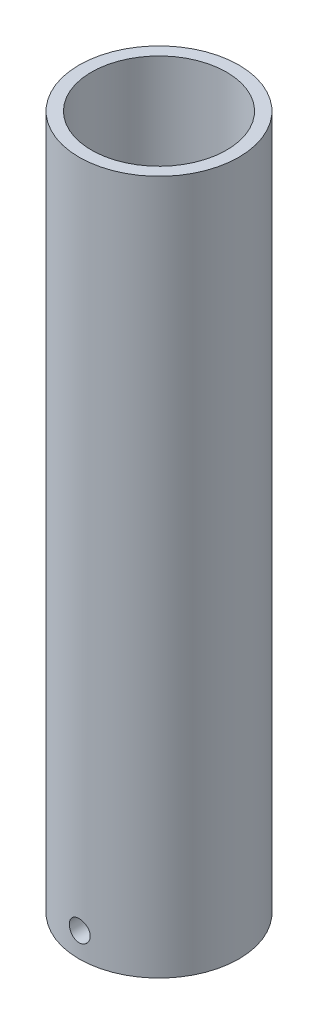
ISO-10303-21;
HEADER;
FILE_DESCRIPTION(('STEP AP214'),'2;1');
FILE_NAME('part.step','',(''),(''),'','','');
FILE_SCHEMA(('AUTOMOTIVE_DESIGN { 1 0 10303 214 1 1 1 1 }'));
ENDSEC;
DATA;
#1=APPLICATION_CONTEXT('core data for automotive mechanical design processes');
#2=APPLICATION_PROTOCOL_DEFINITION('international standard','automotive_design',2000,#1);
#3=PRODUCT_CONTEXT('',#1,'mechanical');
#4=PRODUCT('Part','Part','',(#3));
#5=PRODUCT_RELATED_PRODUCT_CATEGORY('part','',(#4));
#6=PRODUCT_DEFINITION_FORMATION('','',#4);
#7=PRODUCT_DEFINITION_CONTEXT('part definition',#1,'design');
#8=PRODUCT_DEFINITION('design','',#6,#7);
#9=PRODUCT_DEFINITION_SHAPE('','',#8);
#10=(LENGTH_UNIT() NAMED_UNIT(*) SI_UNIT(.MILLI.,.METRE.));
#11=(NAMED_UNIT(*) PLANE_ANGLE_UNIT() SI_UNIT($,.RADIAN.));
#12=(NAMED_UNIT(*) SI_UNIT($,.STERADIAN.) SOLID_ANGLE_UNIT());
#13=UNCERTAINTY_MEASURE_WITH_UNIT(LENGTH_MEASURE(1.E-05),#10,'distance_accuracy_value','');
#14=(GEOMETRIC_REPRESENTATION_CONTEXT(3) GLOBAL_UNCERTAINTY_ASSIGNED_CONTEXT((#13)) GLOBAL_UNIT_ASSIGNED_CONTEXT((#10,
#11,#12)) REPRESENTATION_CONTEXT('',''));
#15=CARTESIAN_POINT('',(0.,0.,0.));
#16=DIRECTION('',(0.,0.,1.));
#17=DIRECTION('',(1.,0.,0.));
#18=AXIS2_PLACEMENT_3D('',#15,#16,#17);
#19=CARTESIAN_POINT('',(-0.2,0.,0.));
#20=DIRECTION('',(0.,1.,0.));
#21=DIRECTION('',(0.,0.,1.));
#22=AXIS2_PLACEMENT_3D('',#19,#20,#21);
#23=PLANE('',#22);
#24=CARTESIAN_POINT('',(0.,0.,0.));
#25=DIRECTION('',(0.,-1.,0.));
#26=DIRECTION('',(0.,0.,-1.));
#27=AXIS2_PLACEMENT_3D('',#24,#25,#26);
#28=CIRCLE('',#27,0.2);
#29=CARTESIAN_POINT('',(0.,0.,-0.2));
#30=VERTEX_POINT('',#29);
#31=EDGE_CURVE('E56',#30,#30,#28,.T.);
#32=ORIENTED_EDGE('',*,*,#31,.F.);
#33=EDGE_LOOP('',(#32));
#34=FACE_BOUND('',#33,.T.);
#35=CARTESIAN_POINT('',(0.,0.,0.));
#36=DIRECTION('',(0.,-1.,0.));
#37=DIRECTION('',(0.,0.,-1.));
#38=AXIS2_PLACEMENT_3D('',#35,#36,#37);
#39=CIRCLE('',#38,7.99999999999999);
#40=CARTESIAN_POINT('',(0.,0.,-7.99999999999999));
#41=VERTEX_POINT('',#40);
#42=EDGE_CURVE('E97',#41,#41,#39,.T.);
#43=ORIENTED_EDGE('',*,*,#42,.T.);
#44=EDGE_LOOP('',(#43));
#45=FACE_BOUND('',#44,.T.);
#46=ADVANCED_FACE('F45',(#34,#45),#23,.F.);
#47=CARTESIAN_POINT('',(0.,0.,0.));
#48=DIRECTION('',(0.,-1.,0.));
#49=DIRECTION('',(0.,0.,-1.));
#50=AXIS2_PLACEMENT_3D('',#47,#48,#49);
#51=CYLINDRICAL_SURFACE('',#50,13.);
#52=CARTESIAN_POINT('',(1.7,7.,12.8883668476654));
#53=CARTESIAN_POINT('',(1.69999598155034,6.90494929370226,12.8883682675296));
#54=CARTESIAN_POINT('',(1.69200134967719,6.80984008676027,12.8894296941299));
#55=CARTESIAN_POINT('',(1.66023707275252,6.62227120273437,12.8935588376241));
#56=CARTESIAN_POINT('',(1.63645117931901,6.52981435712045,12.8966286209646));
#57=CARTESIAN_POINT('',(1.57381987434307,6.35029289326028,12.9044209656405));
#58=CARTESIAN_POINT('',(1.53498497038857,6.2632245617054,12.9091423735479));
#59=CARTESIAN_POINT('',(1.44338103518996,6.09685594746712,12.9197045991932));
#60=CARTESIAN_POINT('',(1.390614285805,6.01755439559732,12.9255452335729));
#61=CARTESIAN_POINT('',(1.27229925481127,5.8684702645573,12.9377277895523));
#62=CARTESIAN_POINT('',(1.20668273845478,5.7987420406487,12.9440722748014));
#63=CARTESIAN_POINT('',(1.06467780234453,5.67125375110328,12.9565246546009));
#64=CARTESIAN_POINT('',(0.988288835262451,5.61349429394584,12.9626325371098));
#65=CARTESIAN_POINT('',(0.826564185125546,5.51138681657475,12.9739499001915));
#66=CARTESIAN_POINT('',(0.741197060537024,5.46708819404045,12.979156042281));
#67=CARTESIAN_POINT('',(0.564155468206664,5.39347638286515,12.988055105209));
#68=CARTESIAN_POINT('',(0.472481255925847,5.36416258768664,12.9917480872941));
#69=CARTESIAN_POINT('',(0.285984711138299,5.3215155089954,12.9971866679456));
#70=CARTESIAN_POINT('',(0.191183409861016,5.30809168455796,12.998943295859));
#71=CARTESIAN_POINT('',(0.000658547200119465,5.2973248853914,13.0003489380416));
#72=CARTESIAN_POINT('',(-0.0950649744984687,5.29998122175884,12.9999980426008));
#73=CARTESIAN_POINT('',(-0.284100659909748,5.32122701909142,12.9972370740316));
#74=CARTESIAN_POINT('',(-0.377423978059192,5.33971909891822,12.9948395866064));
#75=CARTESIAN_POINT('',(-0.55963130078323,5.39195909862445,12.9882689149893));
#76=CARTESIAN_POINT('',(-0.648515214257532,5.42570733143017,12.9840956943745));
#77=CARTESIAN_POINT('',(-0.819620666158618,5.5076043707885,12.9744207722427));
#78=CARTESIAN_POINT('',(-0.901821925335631,5.55579507226374,12.9689152149327));
#79=CARTESIAN_POINT('',(-1.05700747816729,5.66517859319589,12.957191075298));
#80=CARTESIAN_POINT('',(-1.12999130910065,5.72637206498755,12.9509724572071));
#81=CARTESIAN_POINT('',(-1.26524279758115,5.86056886610306,12.9384627236069));
#82=CARTESIAN_POINT('',(-1.32742622555678,5.93365709932377,12.9321714137322));
#83=CARTESIAN_POINT('',(-1.43865645173937,6.08927774687812,12.9202711522997));
#84=CARTESIAN_POINT('',(-1.48770320143602,6.17181019608518,12.9146622032617));
#85=CARTESIAN_POINT('',(-1.57127402992402,6.34405426441702,12.904761847389));
#86=CARTESIAN_POINT('',(-1.60579095220001,6.43376939546624,12.9004710900964));
#87=CARTESIAN_POINT('',(-1.65924547679931,6.61779129839684,12.8937053288786));
#88=CARTESIAN_POINT('',(-1.67818390355227,6.71209782701704,12.8912302288677));
#89=CARTESIAN_POINT('',(-1.69983144601952,6.90188042009742,12.8883937457901));
#90=CARTESIAN_POINT('',(-1.70265928387394,6.9973427200385,12.8880169007332));
#91=CARTESIAN_POINT('',(-1.6923190097839,7.18737973557654,12.889378669903));
#92=CARTESIAN_POINT('',(-1.6791512718694,7.28195447187558,12.8911172346645));
#93=CARTESIAN_POINT('',(-1.63729375132456,7.46717337245688,12.896499802514));
#94=CARTESIAN_POINT('',(-1.60866181231927,7.55783083304991,12.9001367032116));
#95=CARTESIAN_POINT('',(-1.53674832223127,7.73305842848045,12.9089003787163));
#96=CARTESIAN_POINT('',(-1.49346621070252,7.81762833028676,12.9140272105201));
#97=CARTESIAN_POINT('',(-1.39319053092696,7.97881625680111,12.9252299930061));
#98=CARTESIAN_POINT('',(-1.33611932266108,8.05538560664233,12.9313112471203));
#99=CARTESIAN_POINT('',(-1.20999485037198,8.1979014629389,12.9437211706874));
#100=CARTESIAN_POINT('',(-1.14094107528435,8.26384751607218,12.9500498506843));
#101=CARTESIAN_POINT('',(-0.992292110110027,8.38366386677612,12.9622892227921));
#102=CARTESIAN_POINT('',(-0.912633652684416,8.43745600700353,12.9681970511083));
#103=CARTESIAN_POINT('',(-0.745342980374916,8.53089597419027,12.9788858964528));
#104=CARTESIAN_POINT('',(-0.657710939107216,8.57054410902762,12.9836669380075));
#105=CARTESIAN_POINT('',(-0.477216970816129,8.63444243071448,12.991550842588));
#106=CARTESIAN_POINT('',(-0.384371069288825,8.65873726012194,12.9946585671546));
#107=CARTESIAN_POINT('',(-0.195874395466499,8.69138440941937,12.9988659187948));
#108=CARTESIAN_POINT('',(-0.100223762455701,8.69973751962542,12.9999656454155));
#109=CARTESIAN_POINT('',(0.0904051790064449,8.70024837672864,13.000032510039));
#110=CARTESIAN_POINT('',(0.185383181837548,8.69252643465403,12.9990154904843));
#111=CARTESIAN_POINT('',(0.372678931987995,8.66136185762914,12.9949947172056));
#112=CARTESIAN_POINT('',(0.464996682421684,8.63791924108374,12.9919909658076));
#113=CARTESIAN_POINT('',(0.644331838792732,8.57601763338331,12.9843326814566));
#114=CARTESIAN_POINT('',(0.731351459380749,8.53756496703357,12.9796788438784));
#115=CARTESIAN_POINT('',(0.897722008481693,8.44674728813216,12.969234806607));
#116=CARTESIAN_POINT('',(0.977072811129138,8.3943820472914,12.9634445882675));
#117=CARTESIAN_POINT('',(1.12646706303435,8.27678257881579,12.9513218667882));
#118=CARTESIAN_POINT('',(1.19643984782294,8.21145894500371,12.9449857796701));
#119=CARTESIAN_POINT('',(1.32447660106597,8.06998363760175,12.9325137182282));
#120=CARTESIAN_POINT('',(1.38253775203657,7.99382940942451,12.9263777915367));
#121=CARTESIAN_POINT('',(1.48531566684258,7.83248298313169,12.9149731191323));
#122=CARTESIAN_POINT('',(1.52997500677252,7.74725395447826,12.9097081472835));
#123=CARTESIAN_POINT('',(1.60428245857036,7.57048280699699,12.9006856929461));
#124=CARTESIAN_POINT('',(1.63394673705311,7.47894760858375,12.8969265878502));
#125=CARTESIAN_POINT('',(1.67039883145493,7.3224595229532,12.8922448126724));
#126=CARTESIAN_POINT('',(1.68148309154365,7.25848965620739,12.8907979171367));
#127=CARTESIAN_POINT('',(1.69628501506748,7.12968893408623,12.8888584543221));
#128=CARTESIAN_POINT('',(1.70000274199913,7.06485808613703,12.8883658788175));
#129=CARTESIAN_POINT('',(1.7,7.,12.8883668476654));
#130=B_SPLINE_CURVE_WITH_KNOTS('',3,(#52,#53,#54,#55,#56,#57,#58,#59,#60,#61,#62,#63,#64,#65,
#66,#67,#68,#69,#70,#71,#72,#73,#74,#75,#76,#77,#78,#79,#80,#81,#82,#83,#84,#85,#86,#87,#88,#89,
#90,#91,#92,#93,#94,#95,#96,#97,#98,#99,#100,#101,#102,#103,#104,#105,#106,#107,#108,#109,#110,
#111,#112,#113,#114,#115,#116,#117,#118,#119,#120,#121,#122,#123,#124,#125,#126,#127,#128,#129),
.UNSPECIFIED.,.T.,.F.,(4,2,2,2,2,2,2,2,2,2,2,2,2,2,2,2,2,2,2,2,2,2,2,2,2,2,2,2,2,2,2,2,2,2,2,2,
2,2,4),(0.,0.284915155681134,0.57012392945941,0.855133921255911,1.14009726096635,
1.42661698247697,1.71315126677394,2.00072469830814,2.2882864888751,2.57420174421827,
2.86010475051666,3.14426213257541,3.42842534338717,3.71342097167382,3.99843090125629,
4.2855724425011,4.57271504407005,4.85999890972533,5.14726757105102,5.4324165265533,
5.71755881444934,6.00164184441981,6.28573574328646,6.5714681307294,6.8572127078447,
7.14474557747981,7.43227218789428,7.71895886787658,8.00563133490128,8.2901659659279,
8.57470026383773,8.85911479633778,9.14353399603629,9.42998843486429,9.71651055144389,
10.0042433780888,10.291665326356,10.4860795681084,10.6804921340816),.UNSPECIFIED.);
#131=CARTESIAN_POINT('',(1.7,7.,12.8883668476654));
#132=VERTEX_POINT('',#131);
#133=EDGE_CURVE('E12',#132,#132,#130,.T.);
#134=ORIENTED_EDGE('',*,*,#133,.T.);
#135=EDGE_LOOP('',(#134));
#136=FACE_BOUND('',#135,.T.);
#137=CARTESIAN_POINT('',(0.,116.,0.));
#138=DIRECTION('',(0.,-1.,0.));
#139=DIRECTION('',(0.,0.,-1.));
#140=AXIS2_PLACEMENT_3D('',#137,#138,#139);
#141=CIRCLE('',#140,13.);
#142=CARTESIAN_POINT('',(0.,116.,-13.));
#143=VERTEX_POINT('',#142);
#144=EDGE_CURVE('E90',#143,#143,#141,.T.);
#145=ORIENTED_EDGE('',*,*,#144,.T.);
#146=EDGE_LOOP('',(#145));
#147=FACE_BOUND('',#146,.T.);
#148=CARTESIAN_POINT('',(0.,3.,0.));
#149=DIRECTION('',(0.,-1.,0.));
#150=DIRECTION('',(0.,0.,-1.));
#151=AXIS2_PLACEMENT_3D('',#148,#149,#150);
#152=CIRCLE('',#151,13.);
#153=CARTESIAN_POINT('',(0.,3.,-13.));
#154=VERTEX_POINT('',#153);
#155=EDGE_CURVE('E93',#154,#154,#152,.T.);
#156=ORIENTED_EDGE('',*,*,#155,.F.);
#157=EDGE_LOOP('',(#156));
#158=FACE_BOUND('',#157,.T.);
#159=ADVANCED_FACE('F122',(#136,#147,#158),#51,.T.);
#160=CARTESIAN_POINT('',(0.,0.,0.));
#161=DIRECTION('',(0.,-1.,0.));
#162=DIRECTION('',(0.,0.,-1.));
#163=AXIS2_PLACEMENT_3D('',#160,#161,#162);
#164=CYLINDRICAL_SURFACE('',#163,0.2);
#165=CARTESIAN_POINT('',(0.,8.,0.));
#166=DIRECTION('',(0.,-1.,0.));
#167=DIRECTION('',(0.,0.,-1.));
#168=AXIS2_PLACEMENT_3D('',#165,#166,#167);
#169=CIRCLE('',#168,0.2);
#170=CARTESIAN_POINT('',(0.,8.,-0.2));
#171=VERTEX_POINT('',#170);
#172=EDGE_CURVE('E60',#171,#171,#169,.T.);
#173=ORIENTED_EDGE('',*,*,#172,.F.);
#174=EDGE_LOOP('',(#173));
#175=FACE_BOUND('',#174,.T.);
#176=ORIENTED_EDGE('',*,*,#31,.T.);
#177=EDGE_LOOP('',(#176));
#178=FACE_BOUND('',#177,.T.);
#179=ADVANCED_FACE('F127',(#175,#178),#164,.F.);
#180=CARTESIAN_POINT('',(0.,8.,0.));
#181=DIRECTION('',(0.,1.,0.));
#182=DIRECTION('',(0.,0.,1.));
#183=AXIS2_PLACEMENT_3D('',#180,#181,#182);
#184=CONICAL_SURFACE('',#183,0.2,1.02974425867665);
#185=CARTESIAN_POINT('',(0.,8.84120486663859,0.));
#186=DIRECTION('',(0.,-1.,0.));
#187=DIRECTION('',(0.,0.,-1.));
#188=AXIS2_PLACEMENT_3D('',#185,#186,#187);
#189=CIRCLE('',#188,1.6);
#190=CARTESIAN_POINT('',(0.,8.84120486663859,-1.6));
#191=VERTEX_POINT('',#190);
#192=EDGE_CURVE('E64',#191,#191,#189,.T.);
#193=ORIENTED_EDGE('',*,*,#192,.F.);
#194=EDGE_LOOP('',(#193));
#195=FACE_BOUND('',#194,.T.);
#196=ORIENTED_EDGE('',*,*,#172,.T.);
#197=EDGE_LOOP('',(#196));
#198=FACE_BOUND('',#197,.T.);
#199=ADVANCED_FACE('F134',(#195,#198),#184,.F.);
#200=CARTESIAN_POINT('',(0.,0.,0.));
#201=DIRECTION('',(0.,-1.,0.));
#202=DIRECTION('',(0.,0.,-1.));
#203=AXIS2_PLACEMENT_3D('',#200,#201,#202);
#204=CYLINDRICAL_SURFACE('',#203,1.6);
#205=CARTESIAN_POINT('',(0.,11.,0.));
#206=DIRECTION('',(0.,-1.,0.));
#207=DIRECTION('',(0.,0.,-1.));
#208=AXIS2_PLACEMENT_3D('',#205,#206,#207);
#209=CIRCLE('',#208,1.6);
#210=CARTESIAN_POINT('',(0.,11.,-1.6));
#211=VERTEX_POINT('',#210);
#212=EDGE_CURVE('E69',#211,#211,#209,.T.);
#213=ORIENTED_EDGE('',*,*,#212,.F.);
#214=EDGE_LOOP('',(#213));
#215=FACE_BOUND('',#214,.T.);
#216=ORIENTED_EDGE('',*,*,#192,.T.);
#217=EDGE_LOOP('',(#216));
#218=FACE_BOUND('',#217,.T.);
#219=ADVANCED_FACE('F167',(#215,#218),#204,.F.);
#220=CARTESIAN_POINT('',(0.,11.,0.));
#221=DIRECTION('',(0.,1.,0.));
#222=DIRECTION('',(0.,0.,1.));
#223=AXIS2_PLACEMENT_3D('',#220,#221,#222);
#224=CONICAL_SURFACE('',#223,1.6,1.02974425867666);
#225=CARTESIAN_POINT('',(0.,11.9914200213955,0.));
#226=DIRECTION('',(0.,-1.,0.));
#227=DIRECTION('',(0.,0.,-1.));
#228=AXIS2_PLACEMENT_3D('',#225,#226,#227);
#229=CIRCLE('',#228,3.25);
#230=CARTESIAN_POINT('',(0.,11.9914200213955,-3.25));
#231=VERTEX_POINT('',#230);
#232=EDGE_CURVE('E72',#231,#231,#229,.T.);
#233=ORIENTED_EDGE('',*,*,#232,.F.);
#234=EDGE_LOOP('',(#233));
#235=FACE_BOUND('',#234,.T.);
#236=ORIENTED_EDGE('',*,*,#212,.T.);
#237=EDGE_LOOP('',(#236));
#238=FACE_BOUND('',#237,.T.);
#239=ADVANCED_FACE('F163',(#235,#238),#224,.F.);
#240=CARTESIAN_POINT('',(0.,0.,0.));
#241=DIRECTION('',(0.,-1.,0.));
#242=DIRECTION('',(0.,0.,-1.));
#243=AXIS2_PLACEMENT_3D('',#240,#241,#242);
#244=CYLINDRICAL_SURFACE('',#243,3.25);
#245=CARTESIAN_POINT('',(0.,20.9484939167018,0.));
#246=DIRECTION('',(0.,-1.,0.));
#247=DIRECTION('',(0.,0.,-1.));
#248=AXIS2_PLACEMENT_3D('',#245,#246,#247);
#249=CIRCLE('',#248,3.25);
#250=CARTESIAN_POINT('',(0.,20.9484939167018,-3.25));
#251=VERTEX_POINT('',#250);
#252=EDGE_CURVE('E75',#251,#251,#249,.T.);
#253=ORIENTED_EDGE('',*,*,#252,.F.);
#254=EDGE_LOOP('',(#253));
#255=FACE_BOUND('',#254,.T.);
#256=ORIENTED_EDGE('',*,*,#232,.T.);
#257=EDGE_LOOP('',(#256));
#258=FACE_BOUND('',#257,.T.);
#259=ADVANCED_FACE('F159',(#255,#258),#244,.F.);
#260=CARTESIAN_POINT('',(0.,20.9484939167018,0.));
#261=DIRECTION('',(0.,1.,0.));
#262=DIRECTION('',(0.,0.,1.));
#263=AXIS2_PLACEMENT_3D('',#260,#261,#262);
#264=CONICAL_SURFACE('',#263,3.25,1.02974425867665);
#265=CARTESIAN_POINT('',(0.,22.,0.));
#266=DIRECTION('',(0.,-1.,0.));
#267=DIRECTION('',(0.,0.,-1.));
#268=AXIS2_PLACEMENT_3D('',#265,#266,#267);
#269=CIRCLE('',#268,5.);
#270=CARTESIAN_POINT('',(0.,22.,-5.));
#271=VERTEX_POINT('',#270);
#272=EDGE_CURVE('E78',#271,#271,#269,.T.);
#273=ORIENTED_EDGE('',*,*,#272,.F.);
#274=EDGE_LOOP('',(#273));
#275=FACE_BOUND('',#274,.T.);
#276=ORIENTED_EDGE('',*,*,#252,.T.);
#277=EDGE_LOOP('',(#276));
#278=FACE_BOUND('',#277,.T.);
#279=ADVANCED_FACE('F155',(#275,#278),#264,.F.);
#280=CARTESIAN_POINT('',(0.,0.,0.));
#281=DIRECTION('',(0.,-1.,0.));
#282=DIRECTION('',(0.,0.,-1.));
#283=AXIS2_PLACEMENT_3D('',#280,#281,#282);
#284=CYLINDRICAL_SURFACE('',#283,5.);
#285=CARTESIAN_POINT('',(0.,29.,0.));
#286=DIRECTION('',(0.,-1.,0.));
#287=DIRECTION('',(0.,0.,-1.));
#288=AXIS2_PLACEMENT_3D('',#285,#286,#287);
#289=CIRCLE('',#288,5.);
#290=CARTESIAN_POINT('',(0.,29.,-5.));
#291=VERTEX_POINT('',#290);
#292=EDGE_CURVE('E81',#291,#291,#289,.T.);
#293=ORIENTED_EDGE('',*,*,#292,.F.);
#294=EDGE_LOOP('',(#293));
#295=FACE_BOUND('',#294,.T.);
#296=ORIENTED_EDGE('',*,*,#272,.T.);
#297=EDGE_LOOP('',(#296));
#298=FACE_BOUND('',#297,.T.);
#299=ADVANCED_FACE('F151',(#295,#298),#284,.F.);
#300=CARTESIAN_POINT('',(0.,29.,0.));
#301=DIRECTION('',(0.,1.,0.));
#302=DIRECTION('',(0.,0.,1.));
#303=AXIS2_PLACEMENT_3D('',#300,#301,#302);
#304=CONICAL_SURFACE('',#303,5.,1.02974425867666);
#305=CARTESIAN_POINT('',(0.,32.6051637141653,0.));
#306=DIRECTION('',(0.,-1.,0.));
#307=DIRECTION('',(0.,0.,-1.));
#308=AXIS2_PLACEMENT_3D('',#305,#306,#307);
#309=CIRCLE('',#308,11.);
#310=CARTESIAN_POINT('',(0.,32.6051637141653,-11.));
#311=VERTEX_POINT('',#310);
#312=EDGE_CURVE('E84',#311,#311,#309,.T.);
#313=ORIENTED_EDGE('',*,*,#312,.F.);
#314=EDGE_LOOP('',(#313));
#315=FACE_BOUND('',#314,.T.);
#316=ORIENTED_EDGE('',*,*,#292,.T.);
#317=EDGE_LOOP('',(#316));
#318=FACE_BOUND('',#317,.T.);
#319=ADVANCED_FACE('F147',(#315,#318),#304,.F.);
#320=CARTESIAN_POINT('',(0.,0.,0.));
#321=DIRECTION('',(0.,-1.,0.));
#322=DIRECTION('',(0.,0.,-1.));
#323=AXIS2_PLACEMENT_3D('',#320,#321,#322);
#324=CYLINDRICAL_SURFACE('',#323,11.);
#325=CARTESIAN_POINT('',(0.,116.,0.));
#326=DIRECTION('',(0.,-1.,0.));
#327=DIRECTION('',(0.,0.,-1.));
#328=AXIS2_PLACEMENT_3D('',#325,#326,#327);
#329=CIRCLE('',#328,11.);
#330=CARTESIAN_POINT('',(0.,116.,-11.));
#331=VERTEX_POINT('',#330);
#332=EDGE_CURVE('E87',#331,#331,#329,.T.);
#333=ORIENTED_EDGE('',*,*,#332,.F.);
#334=EDGE_LOOP('',(#333));
#335=FACE_BOUND('',#334,.T.);
#336=ORIENTED_EDGE('',*,*,#312,.T.);
#337=EDGE_LOOP('',(#336));
#338=FACE_BOUND('',#337,.T.);
#339=ADVANCED_FACE('F143',(#335,#338),#324,.F.);
#340=CARTESIAN_POINT('',(-11.,116.,0.));
#341=DIRECTION('',(0.,-1.,0.));
#342=DIRECTION('',(0.,0.,-1.));
#343=AXIS2_PLACEMENT_3D('',#340,#341,#342);
#344=PLANE('',#343);
#345=ORIENTED_EDGE('',*,*,#144,.F.);
#346=EDGE_LOOP('',(#345));
#347=FACE_BOUND('',#346,.T.);
#348=ORIENTED_EDGE('',*,*,#332,.T.);
#349=EDGE_LOOP('',(#348));
#350=FACE_BOUND('',#349,.T.);
#351=ADVANCED_FACE('F140',(#347,#350),#344,.F.);
#352=CARTESIAN_POINT('',(0.,3.,0.));
#353=DIRECTION('',(0.,-1.,0.));
#354=DIRECTION('',(0.,0.,-1.));
#355=AXIS2_PLACEMENT_3D('',#352,#353,#354);
#356=PLANE('',#355);
#357=CARTESIAN_POINT('',(0.,3.,0.));
#358=DIRECTION('',(0.,-1.,0.));
#359=DIRECTION('',(0.,0.,-1.));
#360=AXIS2_PLACEMENT_3D('',#357,#358,#359);
#361=CIRCLE('',#360,7.99999999999999);
#362=CARTESIAN_POINT('',(0.,3.,-7.99999999999999));
#363=VERTEX_POINT('',#362);
#364=EDGE_CURVE('E96',#363,#363,#361,.T.);
#365=ORIENTED_EDGE('',*,*,#364,.F.);
#366=EDGE_LOOP('',(#365));
#367=FACE_BOUND('',#366,.T.);
#368=ORIENTED_EDGE('',*,*,#155,.T.);
#369=EDGE_LOOP('',(#368));
#370=FACE_BOUND('',#369,.T.);
#371=ADVANCED_FACE('F117',(#367,#370),#356,.T.);
#372=CARTESIAN_POINT('',(0.,3.,0.));
#373=DIRECTION('',(0.,-1.,0.));
#374=DIRECTION('',(0.,0.,-1.));
#375=AXIS2_PLACEMENT_3D('',#372,#373,#374);
#376=CYLINDRICAL_SURFACE('',#375,7.99999999999999);
#377=ORIENTED_EDGE('',*,*,#364,.T.);
#378=EDGE_LOOP('',(#377));
#379=FACE_BOUND('',#378,.T.);
#380=ORIENTED_EDGE('',*,*,#42,.F.);
#381=EDGE_LOOP('',(#380));
#382=FACE_BOUND('',#381,.T.);
#383=ADVANCED_FACE('F111',(#379,#382),#376,.T.);
#384=CARTESIAN_POINT('',(0.,7.,4.99999999999999));
#385=DIRECTION('',(0.,0.,1.));
#386=DIRECTION('',(1.,0.,0.));
#387=AXIS2_PLACEMENT_3D('',#384,#385,#386);
#388=CYLINDRICAL_SURFACE('',#387,1.7);
#389=CARTESIAN_POINT('',(0.,7.,4.99999999999999));
#390=DIRECTION('',(0.,0.,1.));
#391=DIRECTION('',(1.,0.,0.));
#392=AXIS2_PLACEMENT_3D('',#389,#390,#391);
#393=CIRCLE('',#392,1.7);
#394=CARTESIAN_POINT('',(1.7,7.,4.99999999999999));
#395=VERTEX_POINT('',#394);
#396=EDGE_CURVE('E100',#395,#395,#393,.T.);
#397=ORIENTED_EDGE('',*,*,#396,.F.);
#398=EDGE_LOOP('',(#397));
#399=FACE_BOUND('',#398,.T.);
#400=ORIENTED_EDGE('',*,*,#133,.F.);
#401=EDGE_LOOP('',(#400));
#402=FACE_BOUND('',#401,.T.);
#403=ADVANCED_FACE('F108',(#399,#402),#388,.F.);
#404=CARTESIAN_POINT('',(0.,7.,4.99999999999999));
#405=DIRECTION('',(0.,0.,1.));
#406=DIRECTION('',(1.,0.,0.));
#407=AXIS2_PLACEMENT_3D('',#404,#405,#406);
#408=PLANE('',#407);
#409=ORIENTED_EDGE('',*,*,#396,.T.);
#410=EDGE_LOOP('',(#409));
#411=FACE_BOUND('',#410,.T.);
#412=ADVANCED_FACE('F106',(#411),#408,.T.);
#413=CLOSED_SHELL('',(#46,#159,#179,#199,#219,#239,#259,#279,#299,#319,#339,#351,#371,#383,#403,#412));
#414=MANIFOLD_SOLID_BREP('B2',#413);
#415=ADVANCED_BREP_SHAPE_REPRESENTATION('',(#18,#414),#14);
#416=SHAPE_DEFINITION_REPRESENTATION(#9,#415);
ENDSEC;
END-ISO-10303-21;
